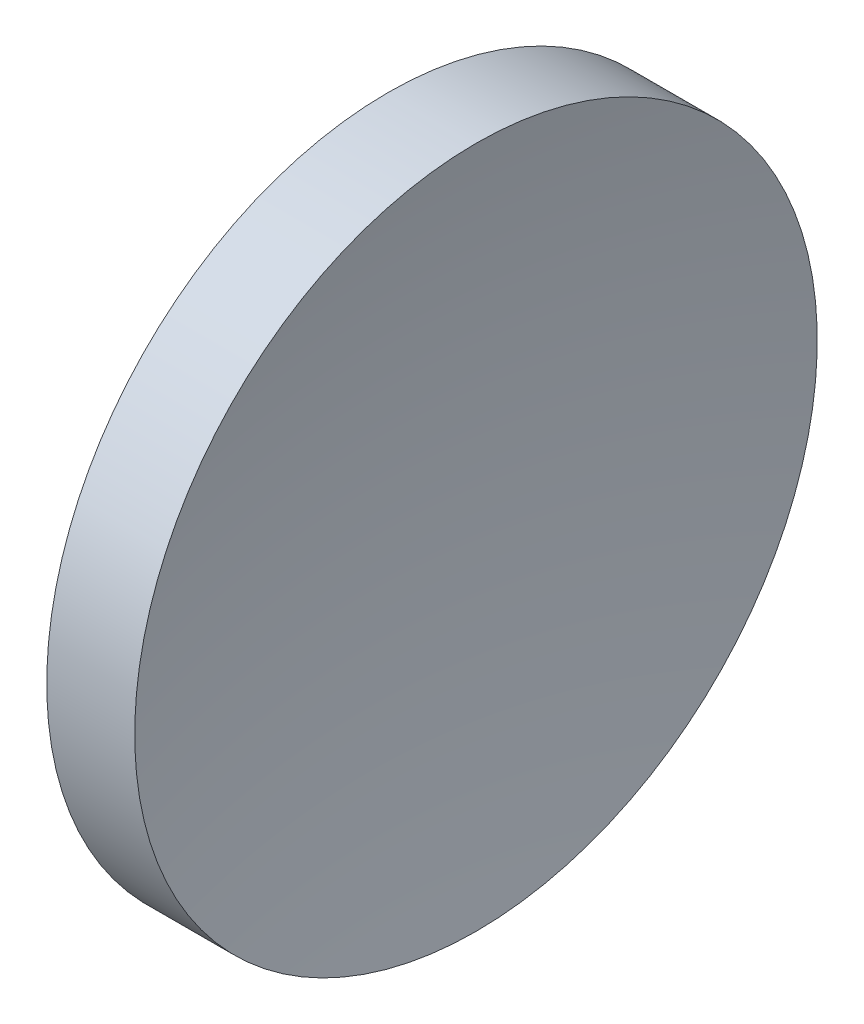
ISO-10303-21;
HEADER;
FILE_DESCRIPTION(('STEP AP214'),'2;1');
FILE_NAME('part.step','',(''),(''),'','','');
FILE_SCHEMA(('AUTOMOTIVE_DESIGN { 1 0 10303 214 1 1 1 1 }'));
ENDSEC;
DATA;
#1=APPLICATION_CONTEXT('core data for automotive mechanical design processes');
#2=APPLICATION_PROTOCOL_DEFINITION('international standard','automotive_design',2000,#1);
#3=PRODUCT_CONTEXT('',#1,'mechanical');
#4=PRODUCT('Part','Part','',(#3));
#5=PRODUCT_RELATED_PRODUCT_CATEGORY('part','',(#4));
#6=PRODUCT_DEFINITION_FORMATION('','',#4);
#7=PRODUCT_DEFINITION_CONTEXT('part definition',#1,'design');
#8=PRODUCT_DEFINITION('design','',#6,#7);
#9=PRODUCT_DEFINITION_SHAPE('','',#8);
#10=(LENGTH_UNIT() NAMED_UNIT(*) SI_UNIT(.MILLI.,.METRE.));
#11=(NAMED_UNIT(*) PLANE_ANGLE_UNIT() SI_UNIT($,.RADIAN.));
#12=(NAMED_UNIT(*) SI_UNIT($,.STERADIAN.) SOLID_ANGLE_UNIT());
#13=UNCERTAINTY_MEASURE_WITH_UNIT(LENGTH_MEASURE(1.E-05),#10,'distance_accuracy_value','');
#14=(GEOMETRIC_REPRESENTATION_CONTEXT(3) GLOBAL_UNCERTAINTY_ASSIGNED_CONTEXT((#13)) GLOBAL_UNIT_ASSIGNED_CONTEXT((#10,
#11,#12)) REPRESENTATION_CONTEXT('',''));
#15=CARTESIAN_POINT('',(0.,0.,0.));
#16=DIRECTION('',(0.,0.,1.));
#17=DIRECTION('',(1.,0.,0.));
#18=AXIS2_PLACEMENT_3D('',#15,#16,#17);
#19=CARTESIAN_POINT('',(123.908190158021,32.5808606757105,0.));
#20=DIRECTION('',(0.,0.,-1.));
#21=DIRECTION('',(0.,-1.,0.));
#22=AXIS2_PLACEMENT_3D('',#19,#20,#21);
#23=CIRCLE('',#22,64.55);
#24=TRIMMED_CURVE('',#23,(PARAMETER_VALUE(-1.57076325533993)),
(PARAMETER_VALUE(1.57076325533993)),.T.,.PARAMETER.);
#25=CARTESIAN_POINT('',(123.908190158021,32.5787259132931,0.));
#26=DIRECTION('',(-1.,0.,0.));
#27=AXIS1_PLACEMENT('',#25,#26);
#28=SURFACE_OF_REVOLUTION('',#24,#27);
#29=CARTESIAN_POINT('',(60.5804780062123,32.5787259132931,0.));
#30=DIRECTION('',(-1.,0.,0.));
#31=DIRECTION('',(0.,-1.,0.));
#32=AXIS2_PLACEMENT_3D('',#29,#30,#31);
#33=CIRCLE('',#32,12.5);
#34=CARTESIAN_POINT('',(60.5804780062123,20.0787259132931,0.));
#35=VERTEX_POINT('',#34);
#36=EDGE_CURVE('E11',#35,#35,#33,.T.);
#37=ORIENTED_EDGE('',*,*,#36,.F.);
#38=EDGE_LOOP('',(#37));
#39=FACE_BOUND('',#38,.T.);
#40=CARTESIAN_POINT('',(59.358190193321,32.5787259132931,0.));
#41=VERTEX_POINT('',#40);
#42=VERTEX_LOOP('',#41);
#43=FACE_BOUND('',#42,.T.);
#44=ADVANCED_FACE('F37',(#39,#43),#28,.F.);
#45=CARTESIAN_POINT('',(55.0073946244212,32.5787259132931,0.));
#46=DIRECTION('',(-1.,0.,0.));
#47=DIRECTION('',(0.,-1.,0.));
#48=AXIS2_PLACEMENT_3D('',#45,#46,#47);
#49=CYLINDRICAL_SURFACE('',#48,12.5);
#50=CARTESIAN_POINT('',(57.3581901580211,32.5787259132931,0.));
#51=DIRECTION('',(-1.,0.,0.));
#52=DIRECTION('',(0.,-1.,0.));
#53=AXIS2_PLACEMENT_3D('',#50,#51,#52);
#54=CIRCLE('',#53,12.5);
#55=CARTESIAN_POINT('',(57.3581901580211,20.0787259132931,0.));
#56=VERTEX_POINT('',#55);
#57=EDGE_CURVE('E43',#56,#56,#54,.T.);
#58=ORIENTED_EDGE('',*,*,#57,.F.);
#59=EDGE_LOOP('',(#58));
#60=FACE_BOUND('',#59,.T.);
#61=ORIENTED_EDGE('',*,*,#36,.T.);
#62=EDGE_LOOP('',(#61));
#63=FACE_BOUND('',#62,.T.);
#64=ADVANCED_FACE('F47',(#60,#63),#49,.T.);
#65=CARTESIAN_POINT('',(57.3581901580211,32.5787259132931,0.));
#66=DIRECTION('',(1.,0.,0.));
#67=DIRECTION('',(0.,1.,0.));
#68=AXIS2_PLACEMENT_3D('',#65,#66,#67);
#69=PLANE('',#68);
#70=ORIENTED_EDGE('',*,*,#57,.T.);
#71=EDGE_LOOP('',(#70));
#72=FACE_BOUND('',#71,.T.);
#73=ADVANCED_FACE('F52',(#72),#69,.F.);
#74=CLOSED_SHELL('',(#44,#64,#73));
#75=MANIFOLD_SOLID_BREP('B2',#74);
#76=ADVANCED_BREP_SHAPE_REPRESENTATION('',(#18,#75),#14);
#77=SHAPE_DEFINITION_REPRESENTATION(#9,#76);
ENDSEC;
END-ISO-10303-21;
